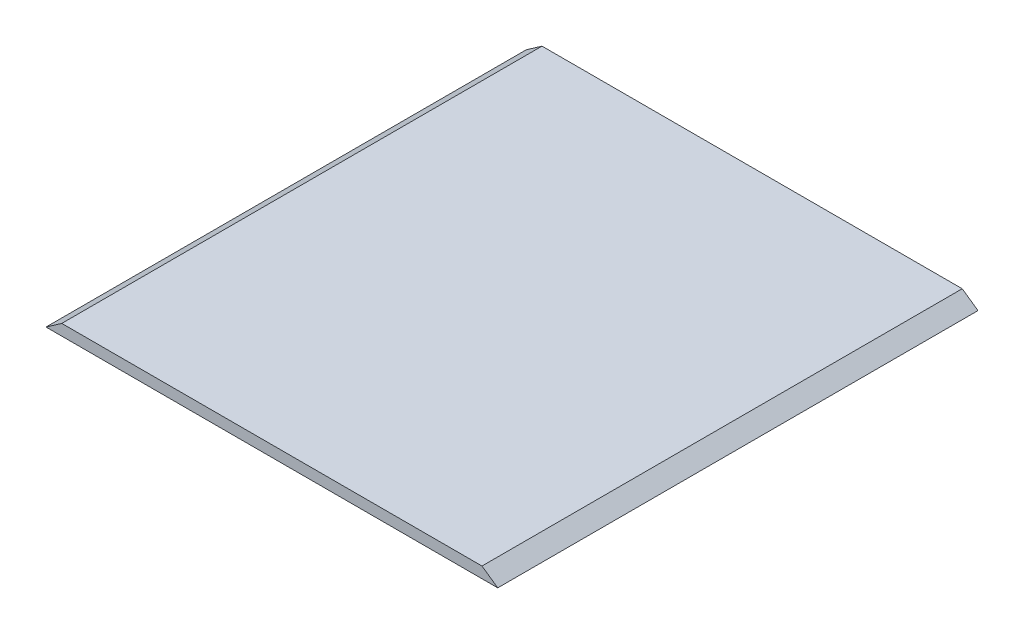
ISO-10303-21;
HEADER;
FILE_DESCRIPTION(('STEP AP214'),'2;1');
FILE_NAME('part.step','',(''),(''),'','','');
FILE_SCHEMA(('AUTOMOTIVE_DESIGN { 1 0 10303 214 1 1 1 1 }'));
ENDSEC;
DATA;
#1=APPLICATION_CONTEXT('core data for automotive mechanical design processes');
#2=APPLICATION_PROTOCOL_DEFINITION('international standard','automotive_design',2000,#1);
#3=PRODUCT_CONTEXT('',#1,'mechanical');
#4=PRODUCT('Part','Part','',(#3));
#5=PRODUCT_RELATED_PRODUCT_CATEGORY('part','',(#4));
#6=PRODUCT_DEFINITION_FORMATION('','',#4);
#7=PRODUCT_DEFINITION_CONTEXT('part definition',#1,'design');
#8=PRODUCT_DEFINITION('design','',#6,#7);
#9=PRODUCT_DEFINITION_SHAPE('','',#8);
#10=(LENGTH_UNIT() NAMED_UNIT(*) SI_UNIT(.MILLI.,.METRE.));
#11=(NAMED_UNIT(*) PLANE_ANGLE_UNIT() SI_UNIT($,.RADIAN.));
#12=(NAMED_UNIT(*) SI_UNIT($,.STERADIAN.) SOLID_ANGLE_UNIT());
#13=UNCERTAINTY_MEASURE_WITH_UNIT(LENGTH_MEASURE(1.E-05),#10,'distance_accuracy_value','');
#14=(GEOMETRIC_REPRESENTATION_CONTEXT(3) GLOBAL_UNCERTAINTY_ASSIGNED_CONTEXT((#13)) GLOBAL_UNIT_ASSIGNED_CONTEXT((#10,
#11,#12)) REPRESENTATION_CONTEXT('',''));
#15=CARTESIAN_POINT('',(0.,0.,0.));
#16=DIRECTION('',(0.,0.,1.));
#17=DIRECTION('',(1.,0.,0.));
#18=AXIS2_PLACEMENT_3D('',#15,#16,#17);
#19=CARTESIAN_POINT('',(0.,-2.29999999999999,200.));
#20=DIRECTION('',(0.,-1.,0.));
#21=DIRECTION('',(1.,0.,0.));
#22=AXIS2_PLACEMENT_3D('',#19,#20,#21);
#23=PLANE('',#22);
#24=DIRECTION('',(-1.,0.,0.));
#25=VECTOR('',#24,1.);
#26=CARTESIAN_POINT('',(0.,-2.29999999999999,0.));
#27=LINE('',#26,#25);
#28=CARTESIAN_POINT('',(94.0694808310139,-2.29999999999998,0.));
#29=VERTEX_POINT('',#28);
#30=CARTESIAN_POINT('',(-94.0694808310139,-2.3,0.));
#31=VERTEX_POINT('',#30);
#32=EDGE_CURVE('E97',#29,#31,#27,.T.);
#33=ORIENTED_EDGE('',*,*,#32,.F.);
#34=DIRECTION('',(0.,0.,-1.));
#35=VECTOR('',#34,1.);
#36=CARTESIAN_POINT('',(94.0694808310139,-2.29999999999998,200.));
#37=LINE('',#36,#35);
#38=CARTESIAN_POINT('',(94.0694808310139,-2.29999999999998,200.));
#39=VERTEX_POINT('',#38);
#40=EDGE_CURVE('E11',#39,#29,#37,.T.);
#41=ORIENTED_EDGE('',*,*,#40,.F.);
#42=DIRECTION('',(-1.,0.,0.));
#43=VECTOR('',#42,1.);
#44=CARTESIAN_POINT('',(0.,-2.29999999999999,200.));
#45=LINE('',#44,#43);
#46=CARTESIAN_POINT('',(-94.0694808310139,-2.3,200.));
#47=VERTEX_POINT('',#46);
#48=EDGE_CURVE('E91',#39,#47,#45,.T.);
#49=ORIENTED_EDGE('',*,*,#48,.T.);
#50=DIRECTION('',(0.,0.,-1.));
#51=VECTOR('',#50,1.);
#52=CARTESIAN_POINT('',(-94.0694808310139,-2.3,200.));
#53=LINE('',#52,#51);
#54=EDGE_CURVE('E72',#47,#31,#53,.T.);
#55=ORIENTED_EDGE('',*,*,#54,.T.);
#56=EDGE_LOOP('',(#33,#41,#49,#55));
#57=FACE_BOUND('',#56,.T.);
#58=ADVANCED_FACE('F34',(#57),#23,.T.);
#59=CARTESIAN_POINT('',(29.8672652434027,42.6548753242069,200.));
#60=DIRECTION('',(0.573576436351017,0.819152044289012,0.));
#61=DIRECTION('',(-0.819152044289012,0.573576436351017,0.));
#62=AXIS2_PLACEMENT_3D('',#59,#60,#61);
#63=PLANE('',#62);
#64=DIRECTION('',(0.819152044289012,-0.573576436351017,0.));
#65=VECTOR('',#64,1.);
#66=CARTESIAN_POINT('',(29.8672652434027,42.6548753242069,0.));
#67=LINE('',#66,#65);
#68=CARTESIAN_POINT('',(87.4999999999997,2.30000000000002,0.));
#69=VERTEX_POINT('',#68);
#70=EDGE_CURVE('E85',#69,#29,#67,.T.);
#71=ORIENTED_EDGE('',*,*,#70,.F.);
#72=DIRECTION('',(0.,0.,-1.));
#73=VECTOR('',#72,1.);
#74=CARTESIAN_POINT('',(87.4999999999997,2.30000000000002,200.));
#75=LINE('',#74,#73);
#76=CARTESIAN_POINT('',(87.4999999999997,2.30000000000002,200.));
#77=VERTEX_POINT('',#76);
#78=EDGE_CURVE('E42',#77,#69,#75,.T.);
#79=ORIENTED_EDGE('',*,*,#78,.F.);
#80=DIRECTION('',(0.819152044289012,-0.573576436351017,0.));
#81=VECTOR('',#80,1.);
#82=CARTESIAN_POINT('',(29.8672652434027,42.6548753242069,200.));
#83=LINE('',#82,#81);
#84=EDGE_CURVE('E83',#77,#39,#83,.T.);
#85=ORIENTED_EDGE('',*,*,#84,.T.);
#86=ORIENTED_EDGE('',*,*,#40,.T.);
#87=EDGE_LOOP('',(#71,#79,#85,#86));
#88=FACE_BOUND('',#87,.T.);
#89=ADVANCED_FACE('F81',(#88),#63,.T.);
#90=CARTESIAN_POINT('',(0.,2.30000000000001,200.));
#91=DIRECTION('',(0.,-1.,0.));
#92=DIRECTION('',(1.,0.,0.));
#93=AXIS2_PLACEMENT_3D('',#90,#91,#92);
#94=PLANE('',#93);
#95=DIRECTION('',(-1.,0.,0.));
#96=VECTOR('',#95,1.);
#97=CARTESIAN_POINT('',(0.,2.30000000000001,0.));
#98=LINE('',#97,#96);
#99=CARTESIAN_POINT('',(-87.5000000000003,2.3,0.));
#100=VERTEX_POINT('',#99);
#101=EDGE_CURVE('E65',#69,#100,#98,.T.);
#102=ORIENTED_EDGE('',*,*,#101,.T.);
#103=DIRECTION('',(0.,0.,-1.));
#104=VECTOR('',#103,1.);
#105=CARTESIAN_POINT('',(-87.5000000000003,2.3,200.));
#106=LINE('',#105,#104);
#107=CARTESIAN_POINT('',(-87.5000000000003,2.3,200.));
#108=VERTEX_POINT('',#107);
#109=EDGE_CURVE('E86',#108,#100,#106,.T.);
#110=ORIENTED_EDGE('',*,*,#109,.F.);
#111=DIRECTION('',(-1.,0.,0.));
#112=VECTOR('',#111,1.);
#113=CARTESIAN_POINT('',(0.,2.30000000000001,200.));
#114=LINE('',#113,#112);
#115=EDGE_CURVE('E87',#77,#108,#114,.T.);
#116=ORIENTED_EDGE('',*,*,#115,.F.);
#117=ORIENTED_EDGE('',*,*,#78,.T.);
#118=EDGE_LOOP('',(#102,#110,#116,#117));
#119=FACE_BOUND('',#118,.T.);
#120=ADVANCED_FACE('F88',(#119),#94,.F.);
#121=CARTESIAN_POINT('',(-29.8672652434063,42.6548753242083,200.));
#122=DIRECTION('',(0.57357643635105,-0.819152044288989,0.));
#123=DIRECTION('',(0.819152044288989,0.57357643635105,0.));
#124=AXIS2_PLACEMENT_3D('',#121,#122,#123);
#125=PLANE('',#124);
#126=DIRECTION('',(-0.819152044288989,-0.57357643635105,0.));
#127=VECTOR('',#126,1.);
#128=CARTESIAN_POINT('',(-29.8672652434063,42.6548753242083,0.));
#129=LINE('',#128,#127);
#130=EDGE_CURVE('E93',#100,#31,#129,.T.);
#131=ORIENTED_EDGE('',*,*,#130,.T.);
#132=ORIENTED_EDGE('',*,*,#54,.F.);
#133=DIRECTION('',(-0.819152044288989,-0.57357643635105,0.));
#134=VECTOR('',#133,1.);
#135=CARTESIAN_POINT('',(-29.8672652434063,42.6548753242083,200.));
#136=LINE('',#135,#134);
#137=EDGE_CURVE('E50',#108,#47,#136,.T.);
#138=ORIENTED_EDGE('',*,*,#137,.F.);
#139=ORIENTED_EDGE('',*,*,#109,.T.);
#140=EDGE_LOOP('',(#131,#132,#138,#139));
#141=FACE_BOUND('',#140,.T.);
#142=ADVANCED_FACE('F106',(#141),#125,.F.);
#143=CARTESIAN_POINT('',(0.,0.,200.));
#144=DIRECTION('',(0.,0.,1.));
#145=DIRECTION('',(1.,0.,0.));
#146=AXIS2_PLACEMENT_3D('',#143,#144,#145);
#147=PLANE('',#146);
#148=ORIENTED_EDGE('',*,*,#48,.F.);
#149=ORIENTED_EDGE('',*,*,#84,.F.);
#150=ORIENTED_EDGE('',*,*,#115,.T.);
#151=ORIENTED_EDGE('',*,*,#137,.T.);
#152=EDGE_LOOP('',(#148,#149,#150,#151));
#153=FACE_BOUND('',#152,.T.);
#154=ADVANCED_FACE('F90',(#153),#147,.T.);
#155=CARTESIAN_POINT('',(0.,0.,0.));
#156=DIRECTION('',(0.,0.,1.));
#157=DIRECTION('',(1.,0.,0.));
#158=AXIS2_PLACEMENT_3D('',#155,#156,#157);
#159=PLANE('',#158);
#160=ORIENTED_EDGE('',*,*,#32,.T.);
#161=ORIENTED_EDGE('',*,*,#130,.F.);
#162=ORIENTED_EDGE('',*,*,#101,.F.);
#163=ORIENTED_EDGE('',*,*,#70,.T.);
#164=EDGE_LOOP('',(#160,#161,#162,#163));
#165=FACE_BOUND('',#164,.T.);
#166=ADVANCED_FACE('F108',(#165),#159,.F.);
#167=CLOSED_SHELL('',(#58,#89,#120,#142,#154,#166));
#168=MANIFOLD_SOLID_BREP('B2',#167);
#169=ADVANCED_BREP_SHAPE_REPRESENTATION('',(#18,#168),#14);
#170=SHAPE_DEFINITION_REPRESENTATION(#9,#169);
ENDSEC;
END-ISO-10303-21;
